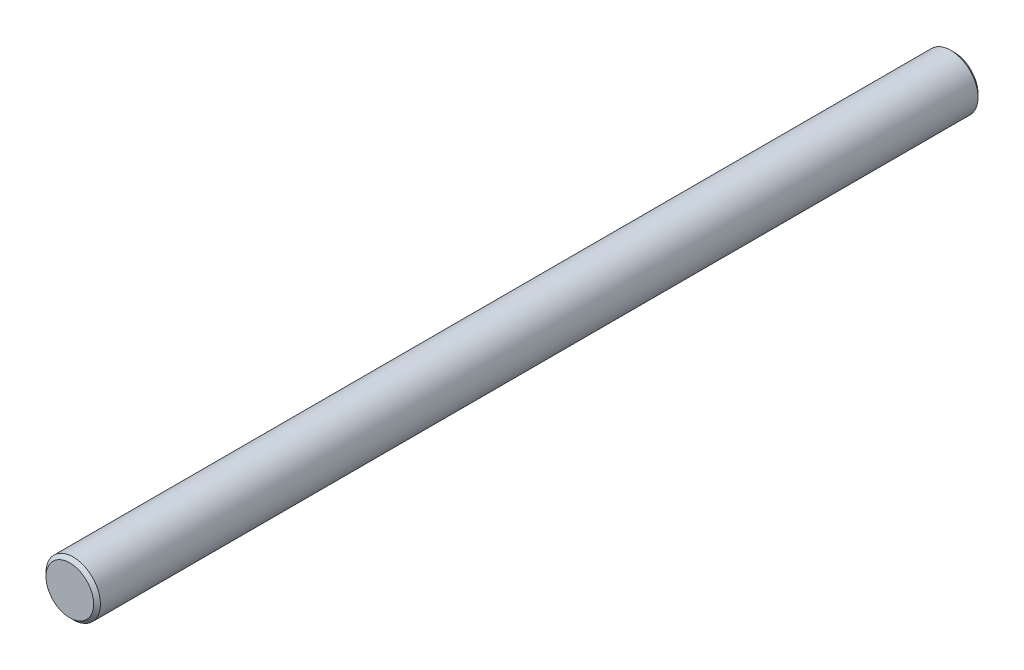
ISO-10303-21;
HEADER;
FILE_DESCRIPTION(('STEP AP214'),'2;1');
FILE_NAME('part.step','',(''),(''),'','','');
FILE_SCHEMA(('AUTOMOTIVE_DESIGN { 1 0 10303 214 1 1 1 1 }'));
ENDSEC;
DATA;
#1=APPLICATION_CONTEXT('core data for automotive mechanical design processes');
#2=APPLICATION_PROTOCOL_DEFINITION('international standard','automotive_design',2000,#1);
#3=PRODUCT_CONTEXT('',#1,'mechanical');
#4=PRODUCT('Part','Part','',(#3));
#5=PRODUCT_RELATED_PRODUCT_CATEGORY('part','',(#4));
#6=PRODUCT_DEFINITION_FORMATION('','',#4);
#7=PRODUCT_DEFINITION_CONTEXT('part definition',#1,'design');
#8=PRODUCT_DEFINITION('design','',#6,#7);
#9=PRODUCT_DEFINITION_SHAPE('','',#8);
#10=(LENGTH_UNIT() NAMED_UNIT(*) SI_UNIT(.MILLI.,.METRE.));
#11=(NAMED_UNIT(*) PLANE_ANGLE_UNIT() SI_UNIT($,.RADIAN.));
#12=(NAMED_UNIT(*) SI_UNIT($,.STERADIAN.) SOLID_ANGLE_UNIT());
#13=UNCERTAINTY_MEASURE_WITH_UNIT(LENGTH_MEASURE(1.E-05),#10,'distance_accuracy_value','');
#14=(GEOMETRIC_REPRESENTATION_CONTEXT(3) GLOBAL_UNCERTAINTY_ASSIGNED_CONTEXT((#13)) GLOBAL_UNIT_ASSIGNED_CONTEXT((#10,
#11,#12)) REPRESENTATION_CONTEXT('',''));
#15=CARTESIAN_POINT('',(0.,0.,0.));
#16=DIRECTION('',(0.,0.,1.));
#17=DIRECTION('',(1.,0.,0.));
#18=AXIS2_PLACEMENT_3D('',#15,#16,#17);
#19=CARTESIAN_POINT('',(0.,0.,67.444));
#20=DIRECTION('',(0.,0.,-1.));
#21=DIRECTION('',(-1.,0.,0.));
#22=AXIS2_PLACEMENT_3D('',#19,#20,#21);
#23=PLANE('',#22);
#24=CARTESIAN_POINT('',(0.,0.,67.4440000000232));
#25=DIRECTION('',(0.,0.,1.));
#26=DIRECTION('',(1.,0.,0.));
#27=AXIS2_PLACEMENT_3D('',#24,#25,#26);
#28=CIRCLE('',#27,3.49999999997411);
#29=CARTESIAN_POINT('',(3.49999999997408,0.,67.4440000000232));
#30=VERTEX_POINT('',#29);
#31=EDGE_CURVE('E18',#30,#30,#28,.T.);
#32=ORIENTED_EDGE('',*,*,#31,.F.);
#33=EDGE_LOOP('',(#32));
#34=FACE_BOUND('',#33,.T.);
#35=ADVANCED_FACE('F15',(#34),#23,.T.);
#36=CARTESIAN_POINT('',(-4.00000000000003,0.,197.444));
#37=DIRECTION('',(0.,0.,1.));
#38=DIRECTION('',(1.,0.,0.));
#39=AXIS2_PLACEMENT_3D('',#36,#37,#38);
#40=PLANE('',#39);
#41=CARTESIAN_POINT('',(0.,0.,197.444000000019));
#42=DIRECTION('',(0.,0.,-1.));
#43=DIRECTION('',(-1.,0.,0.));
#44=AXIS2_PLACEMENT_3D('',#41,#42,#43);
#45=CIRCLE('',#44,3.50000000003092);
#46=CARTESIAN_POINT('',(-3.50000000003095,0.,197.444000000019));
#47=VERTEX_POINT('',#46);
#48=EDGE_CURVE('E27',#47,#47,#45,.T.);
#49=ORIENTED_EDGE('',*,*,#48,.F.);
#50=EDGE_LOOP('',(#49));
#51=FACE_BOUND('',#50,.T.);
#52=ADVANCED_FACE('F42',(#51),#40,.T.);
#53=CARTESIAN_POINT('',(0.,0.,67.9440000000113));
#54=DIRECTION('',(0.,0.,1.));
#55=DIRECTION('',(1.,0.,0.));
#56=AXIS2_PLACEMENT_3D('',#53,#54,#55);
#57=CONICAL_SURFACE('',#56,3.99999999990544,0.785398163340604);
#58=CARTESIAN_POINT('',(0.,0.,67.944));
#59=DIRECTION('',(0.,0.,-1.));
#60=DIRECTION('',(-1.,0.,0.));
#61=AXIS2_PLACEMENT_3D('',#58,#59,#60);
#62=CIRCLE('',#61,3.99999999999998);
#63=CARTESIAN_POINT('',(-4.00000000000001,0.,67.944));
#64=VERTEX_POINT('',#63);
#65=EDGE_CURVE('E22',#64,#64,#62,.F.);
#66=ORIENTED_EDGE('',*,*,#65,.F.);
#67=EDGE_LOOP('',(#66));
#68=FACE_BOUND('',#67,.T.);
#69=ORIENTED_EDGE('',*,*,#31,.T.);
#70=EDGE_LOOP('',(#69));
#71=FACE_BOUND('',#70,.T.);
#72=ADVANCED_FACE('F39',(#68,#71),#57,.T.);
#73=CARTESIAN_POINT('',(0.,0.,196.944000000201));
#74=DIRECTION('',(0.,0.,-1.));
#75=DIRECTION('',(-1.,0.,0.));
#76=AXIS2_PLACEMENT_3D('',#73,#74,#75);
#77=CONICAL_SURFACE('',#76,3.99999999990544,0.785398163454291);
#78=ORIENTED_EDGE('',*,*,#48,.T.);
#79=EDGE_LOOP('',(#78));
#80=FACE_BOUND('',#79,.T.);
#81=CARTESIAN_POINT('',(0.,0.,196.944));
#82=DIRECTION('',(0.,0.,-1.));
#83=DIRECTION('',(-1.,0.,0.));
#84=AXIS2_PLACEMENT_3D('',#81,#82,#83);
#85=CIRCLE('',#84,3.99999999999998);
#86=CARTESIAN_POINT('',(-4.00000000000001,0.,196.944));
#87=VERTEX_POINT('',#86);
#88=EDGE_CURVE('E10',#87,#87,#85,.T.);
#89=ORIENTED_EDGE('',*,*,#88,.F.);
#90=EDGE_LOOP('',(#89));
#91=FACE_BOUND('',#90,.T.);
#92=ADVANCED_FACE('F50',(#80,#91),#77,.T.);
#93=CARTESIAN_POINT('',(0.,0.,132.444));
#94=DIRECTION('',(0.,0.,-1.));
#95=DIRECTION('',(-1.,0.,0.));
#96=AXIS2_PLACEMENT_3D('',#93,#94,#95);
#97=CYLINDRICAL_SURFACE('',#96,3.99999999999998);
#98=ORIENTED_EDGE('',*,*,#88,.T.);
#99=EDGE_LOOP('',(#98));
#100=FACE_BOUND('',#99,.T.);
#101=ORIENTED_EDGE('',*,*,#65,.T.);
#102=EDGE_LOOP('',(#101));
#103=FACE_BOUND('',#102,.T.);
#104=ADVANCED_FACE('F48',(#100,#103),#97,.T.);
#105=CLOSED_SHELL('',(#35,#52,#72,#92,#104));
#106=MANIFOLD_SOLID_BREP('B1',#105);
#107=ADVANCED_BREP_SHAPE_REPRESENTATION('',(#18,#106),#14);
#108=SHAPE_DEFINITION_REPRESENTATION(#9,#107);
ENDSEC;
END-ISO-10303-21;
